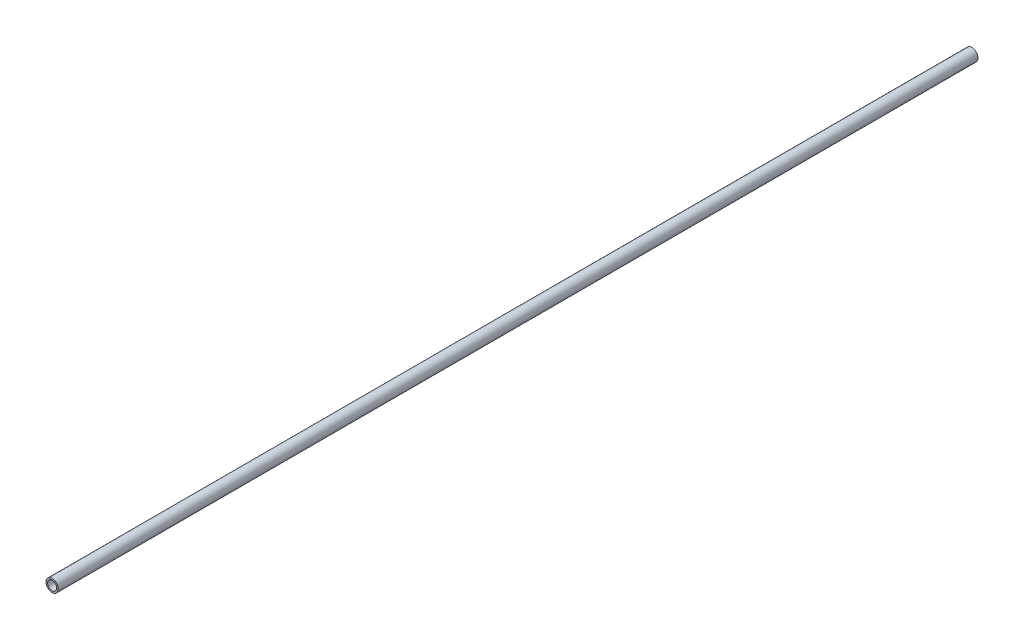
ISO-10303-21;
HEADER;
FILE_DESCRIPTION(('STEP AP214'),'2;1');
FILE_NAME('part.step','',(''),(''),'','','');
FILE_SCHEMA(('AUTOMOTIVE_DESIGN { 1 0 10303 214 1 1 1 1 }'));
ENDSEC;
DATA;
#1=APPLICATION_CONTEXT('core data for automotive mechanical design processes');
#2=APPLICATION_PROTOCOL_DEFINITION('international standard','automotive_design',2000,#1);
#3=PRODUCT_CONTEXT('',#1,'mechanical');
#4=PRODUCT('Part','Part','',(#3));
#5=PRODUCT_RELATED_PRODUCT_CATEGORY('part','',(#4));
#6=PRODUCT_DEFINITION_FORMATION('','',#4);
#7=PRODUCT_DEFINITION_CONTEXT('part definition',#1,'design');
#8=PRODUCT_DEFINITION('design','',#6,#7);
#9=PRODUCT_DEFINITION_SHAPE('','',#8);
#10=(LENGTH_UNIT() NAMED_UNIT(*) SI_UNIT(.MILLI.,.METRE.));
#11=(NAMED_UNIT(*) PLANE_ANGLE_UNIT() SI_UNIT($,.RADIAN.));
#12=(NAMED_UNIT(*) SI_UNIT($,.STERADIAN.) SOLID_ANGLE_UNIT());
#13=UNCERTAINTY_MEASURE_WITH_UNIT(LENGTH_MEASURE(1.E-05),#10,'distance_accuracy_value','');
#14=(GEOMETRIC_REPRESENTATION_CONTEXT(3) GLOBAL_UNCERTAINTY_ASSIGNED_CONTEXT((#13)) GLOBAL_UNIT_ASSIGNED_CONTEXT((#10,
#11,#12)) REPRESENTATION_CONTEXT('',''));
#15=CARTESIAN_POINT('',(0.,0.,0.));
#16=DIRECTION('',(0.,0.,1.));
#17=DIRECTION('',(1.,0.,0.));
#18=AXIS2_PLACEMENT_3D('',#15,#16,#17);
#19=CARTESIAN_POINT('',(0.,0.,5486.4));
#20=DIRECTION('',(0.,0.,1.));
#21=DIRECTION('',(1.,0.,0.));
#22=AXIS2_PLACEMENT_3D('',#19,#20,#21);
#23=PLANE('',#22);
#24=CARTESIAN_POINT('',(0.,0.,5486.4));
#25=DIRECTION('',(0.,0.,1.));
#26=DIRECTION('',(1.,0.,0.));
#27=AXIS2_PLACEMENT_3D('',#24,#25,#26);
#28=CIRCLE('',#27,36.576);
#29=CARTESIAN_POINT('',(36.576,0.,5486.4));
#30=VERTEX_POINT('',#29);
#31=EDGE_CURVE('E10',#30,#30,#28,.T.);
#32=ORIENTED_EDGE('',*,*,#31,.T.);
#33=EDGE_LOOP('',(#32));
#34=FACE_BOUND('',#33,.T.);
#35=CARTESIAN_POINT('',(0.,0.,5486.4));
#36=DIRECTION('',(0.,0.,1.));
#37=DIRECTION('',(1.,0.,0.));
#38=AXIS2_PLACEMENT_3D('',#35,#36,#37);
#39=CIRCLE('',#38,27.051);
#40=CARTESIAN_POINT('',(27.051,0.,5486.4));
#41=VERTEX_POINT('',#40);
#42=EDGE_CURVE('E39',#41,#41,#39,.T.);
#43=ORIENTED_EDGE('',*,*,#42,.F.);
#44=EDGE_LOOP('',(#43));
#45=FACE_BOUND('',#44,.T.);
#46=ADVANCED_FACE('F28',(#34,#45),#23,.T.);
#47=CARTESIAN_POINT('',(0.,0.,0.));
#48=DIRECTION('',(0.,0.,1.));
#49=DIRECTION('',(1.,0.,0.));
#50=AXIS2_PLACEMENT_3D('',#47,#48,#49);
#51=PLANE('',#50);
#52=CARTESIAN_POINT('',(0.,0.,0.));
#53=DIRECTION('',(0.,0.,1.));
#54=DIRECTION('',(1.,0.,0.));
#55=AXIS2_PLACEMENT_3D('',#52,#53,#54);
#56=CIRCLE('',#55,36.576);
#57=CARTESIAN_POINT('',(36.576,0.,0.));
#58=VERTEX_POINT('',#57);
#59=EDGE_CURVE('E32',#58,#58,#56,.T.);
#60=ORIENTED_EDGE('',*,*,#59,.F.);
#61=EDGE_LOOP('',(#60));
#62=FACE_BOUND('',#61,.T.);
#63=CARTESIAN_POINT('',(0.,0.,0.));
#64=DIRECTION('',(0.,0.,1.));
#65=DIRECTION('',(1.,0.,0.));
#66=AXIS2_PLACEMENT_3D('',#63,#64,#65);
#67=CIRCLE('',#66,27.051);
#68=CARTESIAN_POINT('',(27.051,0.,0.));
#69=VERTEX_POINT('',#68);
#70=EDGE_CURVE('E41',#69,#69,#67,.T.);
#71=ORIENTED_EDGE('',*,*,#70,.T.);
#72=EDGE_LOOP('',(#71));
#73=FACE_BOUND('',#72,.T.);
#74=ADVANCED_FACE('F51',(#62,#73),#51,.F.);
#75=CARTESIAN_POINT('',(0.,0.,5486.4));
#76=DIRECTION('',(0.,0.,-1.));
#77=DIRECTION('',(-1.,0.,0.));
#78=AXIS2_PLACEMENT_3D('',#75,#76,#77);
#79=CYLINDRICAL_SURFACE('',#78,36.576);
#80=ORIENTED_EDGE('',*,*,#31,.F.);
#81=EDGE_LOOP('',(#80));
#82=FACE_BOUND('',#81,.T.);
#83=ORIENTED_EDGE('',*,*,#59,.T.);
#84=EDGE_LOOP('',(#83));
#85=FACE_BOUND('',#84,.T.);
#86=ADVANCED_FACE('F30',(#82,#85),#79,.T.);
#87=CARTESIAN_POINT('',(0.,0.,5486.4));
#88=DIRECTION('',(0.,0.,-1.));
#89=DIRECTION('',(-1.,0.,0.));
#90=AXIS2_PLACEMENT_3D('',#87,#88,#89);
#91=CYLINDRICAL_SURFACE('',#90,27.051);
#92=ORIENTED_EDGE('',*,*,#42,.T.);
#93=EDGE_LOOP('',(#92));
#94=FACE_BOUND('',#93,.T.);
#95=ORIENTED_EDGE('',*,*,#70,.F.);
#96=EDGE_LOOP('',(#95));
#97=FACE_BOUND('',#96,.T.);
#98=ADVANCED_FACE('F47',(#94,#97),#91,.F.);
#99=CLOSED_SHELL('',(#46,#74,#86,#98));
#100=MANIFOLD_SOLID_BREP('B2',#99);
#101=ADVANCED_BREP_SHAPE_REPRESENTATION('',(#18,#100),#14);
#102=SHAPE_DEFINITION_REPRESENTATION(#9,#101);
ENDSEC;
END-ISO-10303-21;
